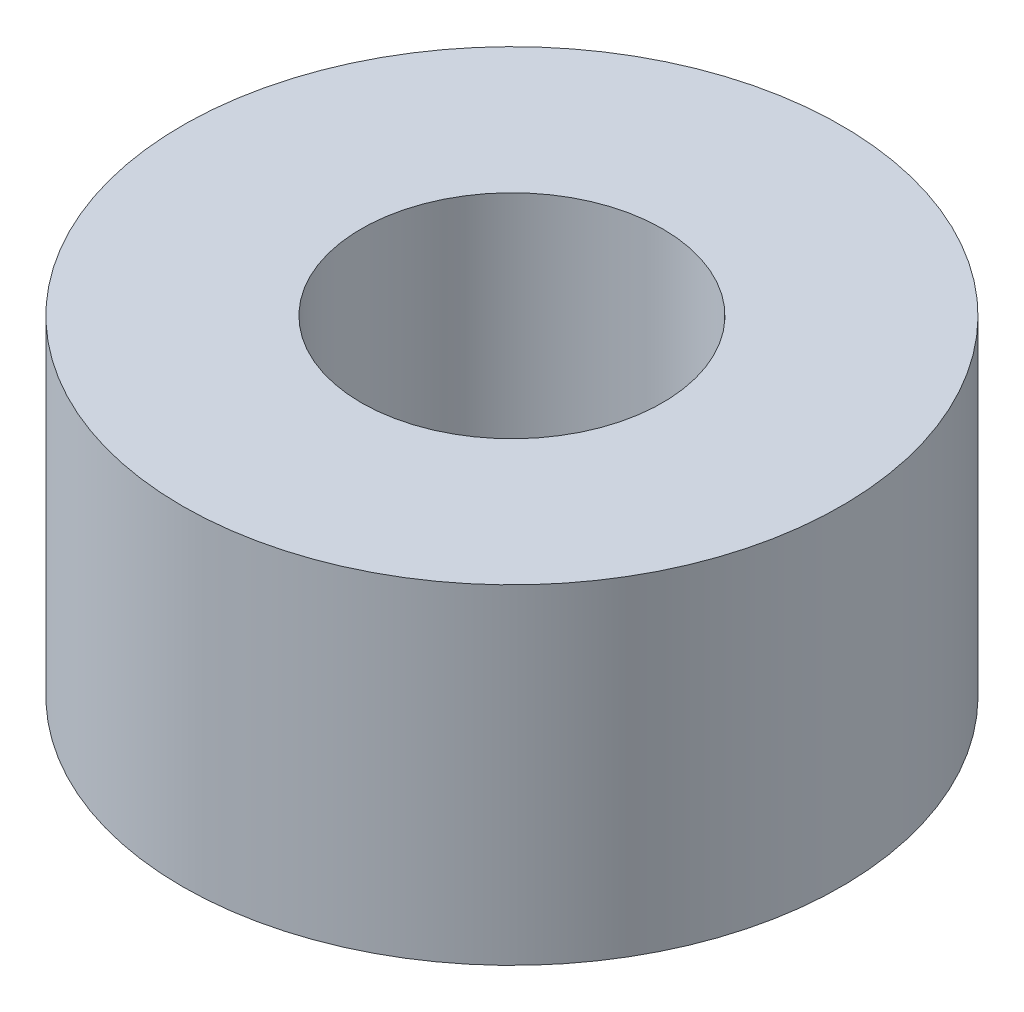
ISO-10303-21;
HEADER;
FILE_DESCRIPTION(('STEP AP214'),'2;1');
FILE_NAME('part.step','',(''),(''),'','','');
FILE_SCHEMA(('AUTOMOTIVE_DESIGN { 1 0 10303 214 1 1 1 1 }'));
ENDSEC;
DATA;
#1=APPLICATION_CONTEXT('core data for automotive mechanical design processes');
#2=APPLICATION_PROTOCOL_DEFINITION('international standard','automotive_design',2000,#1);
#3=PRODUCT_CONTEXT('',#1,'mechanical');
#4=PRODUCT('Part','Part','',(#3));
#5=PRODUCT_RELATED_PRODUCT_CATEGORY('part','',(#4));
#6=PRODUCT_DEFINITION_FORMATION('','',#4);
#7=PRODUCT_DEFINITION_CONTEXT('part definition',#1,'design');
#8=PRODUCT_DEFINITION('design','',#6,#7);
#9=PRODUCT_DEFINITION_SHAPE('','',#8);
#10=(LENGTH_UNIT() NAMED_UNIT(*) SI_UNIT(.MILLI.,.METRE.));
#11=(NAMED_UNIT(*) PLANE_ANGLE_UNIT() SI_UNIT($,.RADIAN.));
#12=(NAMED_UNIT(*) SI_UNIT($,.STERADIAN.) SOLID_ANGLE_UNIT());
#13=UNCERTAINTY_MEASURE_WITH_UNIT(LENGTH_MEASURE(1.E-05),#10,'distance_accuracy_value','');
#14=(GEOMETRIC_REPRESENTATION_CONTEXT(3) GLOBAL_UNCERTAINTY_ASSIGNED_CONTEXT((#13)) GLOBAL_UNIT_ASSIGNED_CONTEXT((#10,
#11,#12)) REPRESENTATION_CONTEXT('',''));
#15=CARTESIAN_POINT('',(0.,0.,0.));
#16=DIRECTION('',(0.,0.,1.));
#17=DIRECTION('',(1.,0.,0.));
#18=AXIS2_PLACEMENT_3D('',#15,#16,#17);
#19=CARTESIAN_POINT('',(0.,3.5,0.));
#20=DIRECTION('',(0.,1.,0.));
#21=DIRECTION('',(0.,0.,1.));
#22=AXIS2_PLACEMENT_3D('',#19,#20,#21);
#23=PLANE('',#22);
#24=CARTESIAN_POINT('',(0.,3.5,0.));
#25=DIRECTION('',(0.,1.,0.));
#26=DIRECTION('',(0.,0.,1.));
#27=AXIS2_PLACEMENT_3D('',#24,#25,#26);
#28=CIRCLE('',#27,3.5);
#29=CARTESIAN_POINT('',(0.,3.5,3.5));
#30=VERTEX_POINT('',#29);
#31=EDGE_CURVE('E10',#30,#30,#28,.T.);
#32=ORIENTED_EDGE('',*,*,#31,.T.);
#33=EDGE_LOOP('',(#32));
#34=FACE_BOUND('',#33,.T.);
#35=CARTESIAN_POINT('',(0.,3.5,0.));
#36=DIRECTION('',(0.,1.,0.));
#37=DIRECTION('',(0.,0.,1.));
#38=AXIS2_PLACEMENT_3D('',#35,#36,#37);
#39=CIRCLE('',#38,1.6);
#40=CARTESIAN_POINT('',(0.,3.5,1.6));
#41=VERTEX_POINT('',#40);
#42=EDGE_CURVE('E42',#41,#41,#39,.T.);
#43=ORIENTED_EDGE('',*,*,#42,.F.);
#44=EDGE_LOOP('',(#43));
#45=FACE_BOUND('',#44,.T.);
#46=ADVANCED_FACE('F31',(#34,#45),#23,.T.);
#47=CARTESIAN_POINT('',(0.,0.,0.));
#48=DIRECTION('',(0.,1.,0.));
#49=DIRECTION('',(0.,0.,1.));
#50=AXIS2_PLACEMENT_3D('',#47,#48,#49);
#51=PLANE('',#50);
#52=CARTESIAN_POINT('',(0.,0.,0.));
#53=DIRECTION('',(0.,1.,0.));
#54=DIRECTION('',(0.,0.,1.));
#55=AXIS2_PLACEMENT_3D('',#52,#53,#54);
#56=CIRCLE('',#55,3.5);
#57=CARTESIAN_POINT('',(0.,0.,3.5));
#58=VERTEX_POINT('',#57);
#59=EDGE_CURVE('E35',#58,#58,#56,.T.);
#60=ORIENTED_EDGE('',*,*,#59,.F.);
#61=EDGE_LOOP('',(#60));
#62=FACE_BOUND('',#61,.T.);
#63=CARTESIAN_POINT('',(0.,0.,0.));
#64=DIRECTION('',(0.,1.,0.));
#65=DIRECTION('',(0.,0.,1.));
#66=AXIS2_PLACEMENT_3D('',#63,#64,#65);
#67=CIRCLE('',#66,1.6);
#68=CARTESIAN_POINT('',(0.,0.,1.6));
#69=VERTEX_POINT('',#68);
#70=EDGE_CURVE('E44',#69,#69,#67,.T.);
#71=ORIENTED_EDGE('',*,*,#70,.T.);
#72=EDGE_LOOP('',(#71));
#73=FACE_BOUND('',#72,.T.);
#74=ADVANCED_FACE('F54',(#62,#73),#51,.F.);
#75=CARTESIAN_POINT('',(0.,3.5,0.));
#76=DIRECTION('',(0.,-1.,0.));
#77=DIRECTION('',(0.,0.,-1.));
#78=AXIS2_PLACEMENT_3D('',#75,#76,#77);
#79=CYLINDRICAL_SURFACE('',#78,3.5);
#80=ORIENTED_EDGE('',*,*,#31,.F.);
#81=EDGE_LOOP('',(#80));
#82=FACE_BOUND('',#81,.T.);
#83=ORIENTED_EDGE('',*,*,#59,.T.);
#84=EDGE_LOOP('',(#83));
#85=FACE_BOUND('',#84,.T.);
#86=ADVANCED_FACE('F33',(#82,#85),#79,.T.);
#87=CARTESIAN_POINT('',(0.,3.5,0.));
#88=DIRECTION('',(0.,-1.,0.));
#89=DIRECTION('',(0.,0.,-1.));
#90=AXIS2_PLACEMENT_3D('',#87,#88,#89);
#91=CYLINDRICAL_SURFACE('',#90,1.6);
#92=ORIENTED_EDGE('',*,*,#42,.T.);
#93=EDGE_LOOP('',(#92));
#94=FACE_BOUND('',#93,.T.);
#95=ORIENTED_EDGE('',*,*,#70,.F.);
#96=EDGE_LOOP('',(#95));
#97=FACE_BOUND('',#96,.T.);
#98=ADVANCED_FACE('F50',(#94,#97),#91,.F.);
#99=CLOSED_SHELL('',(#46,#74,#86,#98));
#100=MANIFOLD_SOLID_BREP('B2',#99);
#101=ADVANCED_BREP_SHAPE_REPRESENTATION('',(#18,#100),#14);
#102=SHAPE_DEFINITION_REPRESENTATION(#9,#101);
ENDSEC;
END-ISO-10303-21;
